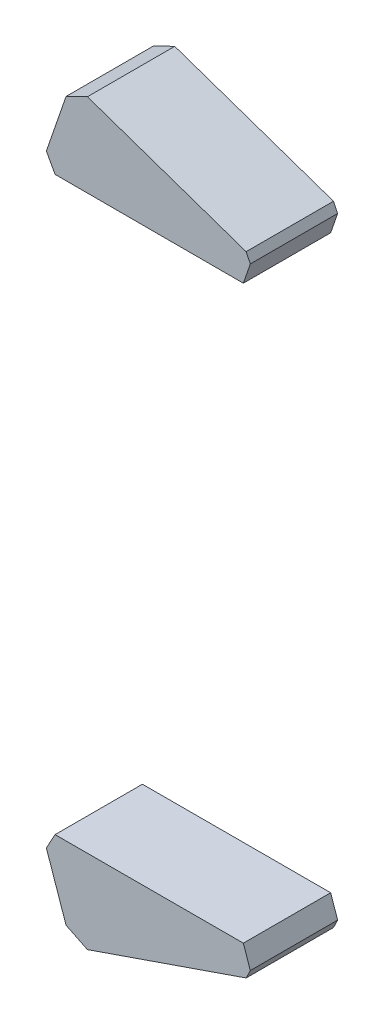
ISO-10303-21;
HEADER;
FILE_DESCRIPTION(('STEP AP214'),'2;1');
FILE_NAME('part.step','',(''),(''),'','','');
FILE_SCHEMA(('AUTOMOTIVE_DESIGN { 1 0 10303 214 1 1 1 1 }'));
ENDSEC;
DATA;
#1=APPLICATION_CONTEXT('core data for automotive mechanical design processes');
#2=APPLICATION_PROTOCOL_DEFINITION('international standard','automotive_design',2000,#1);
#3=PRODUCT_CONTEXT('',#1,'mechanical');
#4=PRODUCT('Part','Part','',(#3));
#5=PRODUCT_RELATED_PRODUCT_CATEGORY('part','',(#4));
#6=PRODUCT_DEFINITION_FORMATION('','',#4);
#7=PRODUCT_DEFINITION_CONTEXT('part definition',#1,'design');
#8=PRODUCT_DEFINITION('design','',#6,#7);
#9=PRODUCT_DEFINITION_SHAPE('','',#8);
#10=(LENGTH_UNIT() NAMED_UNIT(*) SI_UNIT(.MILLI.,.METRE.));
#11=(NAMED_UNIT(*) PLANE_ANGLE_UNIT() SI_UNIT($,.RADIAN.));
#12=(NAMED_UNIT(*) SI_UNIT($,.STERADIAN.) SOLID_ANGLE_UNIT());
#13=UNCERTAINTY_MEASURE_WITH_UNIT(LENGTH_MEASURE(1.E-05),#10,'distance_accuracy_value','');
#14=(GEOMETRIC_REPRESENTATION_CONTEXT(3) GLOBAL_UNCERTAINTY_ASSIGNED_CONTEXT((#13)) GLOBAL_UNIT_ASSIGNED_CONTEXT((#10,
#11,#12)) REPRESENTATION_CONTEXT('',''));
#15=CARTESIAN_POINT('',(0.,0.,0.));
#16=DIRECTION('',(0.,0.,1.));
#17=DIRECTION('',(1.,0.,0.));
#18=AXIS2_PLACEMENT_3D('',#15,#16,#17);
#19=CARTESIAN_POINT('',(-460.729069613653,-85.1233312154027,174.));
#20=DIRECTION('',(-0.876369714970138,0.481638996223481,0.));
#21=DIRECTION('',(-0.481638996223481,-0.876369714970138,0.));
#22=AXIS2_PLACEMENT_3D('',#19,#20,#21);
#23=PLANE('',#22);
#24=DIRECTION('',(0.481638996223481,0.876369714970137,0.));
#25=VECTOR('',#24,1.);
#26=CARTESIAN_POINT('',(-463.328308859307,-89.8527957619074,174.));
#27=LINE('',#26,#25);
#28=CARTESIAN_POINT('',(-463.328308859307,-89.8527957619074,174.));
#29=VERTEX_POINT('',#28);
#30=CARTESIAN_POINT('',(-460.729069613653,-85.1233312154027,174.));
#31=VERTEX_POINT('',#30);
#32=EDGE_CURVE('E140',#29,#31,#27,.T.);
#33=ORIENTED_EDGE('',*,*,#32,.F.);
#34=DIRECTION('',(0.,0.,1.));
#35=VECTOR('',#34,1.);
#36=CARTESIAN_POINT('',(-463.328308859307,-89.8527957619074,174.));
#37=LINE('',#36,#35);
#38=CARTESIAN_POINT('',(-463.328308859307,-89.8527957619074,200.));
#39=VERTEX_POINT('',#38);
#40=EDGE_CURVE('E179',#29,#39,#37,.T.);
#41=ORIENTED_EDGE('',*,*,#40,.T.);
#42=DIRECTION('',(-0.481638996223481,-0.876369714970138,0.));
#43=VECTOR('',#42,1.);
#44=CARTESIAN_POINT('',(-460.729069613653,-85.1233312154027,200.));
#45=LINE('',#44,#43);
#46=CARTESIAN_POINT('',(-460.729069613653,-85.1233312154027,200.));
#47=VERTEX_POINT('',#46);
#48=EDGE_CURVE('E170',#47,#39,#45,.T.);
#49=ORIENTED_EDGE('',*,*,#48,.F.);
#50=DIRECTION('',(0.,0.,1.));
#51=VECTOR('',#50,1.);
#52=CARTESIAN_POINT('',(-460.729069613653,-85.1233312154027,174.));
#53=LINE('',#52,#51);
#54=EDGE_CURVE('E138',#31,#47,#53,.T.);
#55=ORIENTED_EDGE('',*,*,#54,.F.);
#56=EDGE_LOOP('',(#33,#41,#49,#55));
#57=FACE_BOUND('',#56,.T.);
#58=ADVANCED_FACE('F273',(#57),#23,.T.);
#59=CARTESIAN_POINT('',(-404.675188024279,-85.0829941548219,174.));
#60=DIRECTION('',(-0.000719612076684251,0.999999741079198,0.));
#61=DIRECTION('',(-0.999999741079198,-0.000719612076684251,0.));
#62=AXIS2_PLACEMENT_3D('',#59,#60,#61);
#63=PLANE('',#62);
#64=DIRECTION('',(0.,0.,1.));
#65=VECTOR('',#64,1.);
#66=CARTESIAN_POINT('',(-404.675188024279,-85.0829941548219,174.));
#67=LINE('',#66,#65);
#68=CARTESIAN_POINT('',(-404.675188024279,-85.0829941548219,200.));
#69=VERTEX_POINT('',#68);
#70=CARTESIAN_POINT('',(-404.675188024279,-85.0829941548219,174.));
#71=VERTEX_POINT('',#70);
#72=EDGE_CURVE('E126',#69,#71,#67,.F.);
#73=ORIENTED_EDGE('',*,*,#72,.T.);
#74=DIRECTION('',(-0.999999741079198,-0.000719612076684251,0.));
#75=VECTOR('',#74,1.);
#76=CARTESIAN_POINT('',(-404.675188024279,-85.0829941548219,174.));
#77=LINE('',#76,#75);
#78=EDGE_CURVE('E119',#71,#31,#77,.T.);
#79=ORIENTED_EDGE('',*,*,#78,.T.);
#80=ORIENTED_EDGE('',*,*,#54,.T.);
#81=DIRECTION('',(-0.999999741079198,-0.000719612076684251,0.));
#82=VECTOR('',#81,1.);
#83=CARTESIAN_POINT('',(-404.675188024279,-85.0829941548219,200.));
#84=LINE('',#83,#82);
#85=EDGE_CURVE('E133',#47,#69,#84,.F.);
#86=ORIENTED_EDGE('',*,*,#85,.T.);
#87=EDGE_LOOP('',(#73,#79,#80,#86));
#88=FACE_BOUND('',#87,.T.);
#89=ADVANCED_FACE('F270',(#88),#63,.T.);
#90=CARTESIAN_POINT('',(-463.328308859307,-89.8527957619074,174.));
#91=DIRECTION('',(-0.945284048009157,-0.326248476746519,0.));
#92=DIRECTION('',(0.326248476746519,-0.945284048009157,0.));
#93=AXIS2_PLACEMENT_3D('',#90,#91,#92);
#94=PLANE('',#93);
#95=DIRECTION('',(0.326248476746519,-0.945284048009157,0.));
#96=VECTOR('',#95,1.);
#97=CARTESIAN_POINT('',(-464.510205805689,-86.4283251223888,200.));
#98=LINE('',#97,#96);
#99=CARTESIAN_POINT('',(-457.455836277869,-106.867908626072,200.));
#100=VERTEX_POINT('',#99);
#101=EDGE_CURVE('E167',#39,#100,#98,.T.);
#102=ORIENTED_EDGE('',*,*,#101,.F.);
#103=ORIENTED_EDGE('',*,*,#40,.F.);
#104=DIRECTION('',(0.326248476746519,-0.945284048009157,0.));
#105=VECTOR('',#104,1.);
#106=CARTESIAN_POINT('',(-464.510205805689,-86.4283251223888,174.));
#107=LINE('',#106,#105);
#108=CARTESIAN_POINT('',(-457.455836277869,-106.867908626072,174.));
#109=VERTEX_POINT('',#108);
#110=EDGE_CURVE('E143',#109,#29,#107,.F.);
#111=ORIENTED_EDGE('',*,*,#110,.F.);
#112=DIRECTION('',(0.,0.,1.));
#113=VECTOR('',#112,1.);
#114=CARTESIAN_POINT('',(-457.455836277869,-106.867908626072,174.));
#115=LINE('',#114,#113);
#116=EDGE_CURVE('E182',#109,#100,#115,.T.);
#117=ORIENTED_EDGE('',*,*,#116,.T.);
#118=EDGE_LOOP('',(#102,#103,#111,#117));
#119=FACE_BOUND('',#118,.T.);
#120=ADVANCED_FACE('F275',(#119),#94,.T.);
#121=CARTESIAN_POINT('',(-402.595900111108,-91.1075975955482,174.));
#122=DIRECTION('',(0.945284048009157,0.326248476746519,0.));
#123=DIRECTION('',(-0.326248476746519,0.945284048009157,0.));
#124=AXIS2_PLACEMENT_3D('',#121,#122,#123);
#125=PLANE('',#124);
#126=DIRECTION('',(0.326248476746519,-0.945284048009157,0.));
#127=VECTOR('',#126,1.);
#128=CARTESIAN_POINT('',(-410.629015069167,-67.8321619478372,174.));
#129=LINE('',#128,#127);
#130=CARTESIAN_POINT('',(-402.595900111108,-91.1075975955482,174.));
#131=VERTEX_POINT('',#130);
#132=EDGE_CURVE('E155',#71,#131,#129,.T.);
#133=ORIENTED_EDGE('',*,*,#132,.F.);
#134=ORIENTED_EDGE('',*,*,#72,.F.);
#135=DIRECTION('',(-0.326248476746519,0.945284048009157,0.));
#136=VECTOR('',#135,1.);
#137=CARTESIAN_POINT('',(-402.595900111108,-91.1075975955482,200.));
#138=LINE('',#137,#136);
#139=CARTESIAN_POINT('',(-402.595900111108,-91.1075975955482,200.));
#140=VERTEX_POINT('',#139);
#141=EDGE_CURVE('E161',#69,#140,#138,.F.);
#142=ORIENTED_EDGE('',*,*,#141,.T.);
#143=DIRECTION('',(0.,0.,1.));
#144=VECTOR('',#143,1.);
#145=CARTESIAN_POINT('',(-402.595900111108,-91.1075975955482,174.));
#146=LINE('',#145,#144);
#147=EDGE_CURVE('E158',#140,#131,#146,.F.);
#148=ORIENTED_EDGE('',*,*,#147,.T.);
#149=EDGE_LOOP('',(#133,#134,#142,#148));
#150=FACE_BOUND('',#149,.T.);
#151=ADVANCED_FACE('F268',(#150),#125,.T.);
#152=CARTESIAN_POINT('',(-464.510205805689,-86.4283251223888,174.));
#153=DIRECTION('',(0.,0.,-1.));
#154=DIRECTION('',(0.945284048009157,0.326248476746519,0.));
#155=AXIS2_PLACEMENT_3D('',#152,#153,#154);
#156=PLANE('',#155);
#157=ORIENTED_EDGE('',*,*,#32,.T.);
#158=ORIENTED_EDGE('',*,*,#78,.F.);
#159=ORIENTED_EDGE('',*,*,#132,.T.);
#160=DIRECTION('',(-0.437724250235498,-0.899109270753991,0.));
#161=VECTOR('',#160,1.);
#162=CARTESIAN_POINT('',(-402.595900111108,-91.1075975955482,174.));
#163=LINE('',#162,#161);
#164=CARTESIAN_POINT('',(-403.833971253633,-93.6506626450591,174.));
#165=VERTEX_POINT('',#164);
#166=EDGE_CURVE('E152',#131,#165,#163,.T.);
#167=ORIENTED_EDGE('',*,*,#166,.T.);
#168=DIRECTION('',(0.945284048009157,0.326248476746519,0.));
#169=VECTOR('',#168,1.);
#170=CARTESIAN_POINT('',(-455.824593894137,-111.594328866118,174.));
#171=LINE('',#170,#169);
#172=CARTESIAN_POINT('',(-451.098173654091,-109.963086482385,174.));
#173=VERTEX_POINT('',#172);
#174=EDGE_CURVE('E149',#165,#173,#171,.F.);
#175=ORIENTED_EDGE('',*,*,#174,.T.);
#176=DIRECTION('',(-0.89910927075399,0.4377242502355,0.));
#177=VECTOR('',#176,1.);
#178=CARTESIAN_POINT('',(-451.098173654091,-109.963086482385,174.));
#179=LINE('',#178,#177);
#180=EDGE_CURVE('E146',#173,#109,#179,.T.);
#181=ORIENTED_EDGE('',*,*,#180,.T.);
#182=ORIENTED_EDGE('',*,*,#110,.T.);
#183=EDGE_LOOP('',(#157,#158,#159,#167,#175,#181,#182));
#184=FACE_BOUND('',#183,.T.);
#185=ADVANCED_FACE('F265',(#184),#156,.T.);
#186=CARTESIAN_POINT('',(-457.455836277869,-106.867908626072,174.));
#187=DIRECTION('',(-0.4377242502355,-0.89910927075399,0.));
#188=DIRECTION('',(0.89910927075399,-0.4377242502355,0.));
#189=AXIS2_PLACEMENT_3D('',#186,#187,#188);
#190=PLANE('',#189);
#191=DIRECTION('',(0.89910927075399,-0.437724250235501,0.));
#192=VECTOR('',#191,1.);
#193=CARTESIAN_POINT('',(-457.455836277869,-106.867908626072,200.));
#194=LINE('',#193,#192);
#195=CARTESIAN_POINT('',(-451.098173654091,-109.963086482385,200.));
#196=VERTEX_POINT('',#195);
#197=EDGE_CURVE('E164',#100,#196,#194,.T.);
#198=ORIENTED_EDGE('',*,*,#197,.F.);
#199=ORIENTED_EDGE('',*,*,#116,.F.);
#200=ORIENTED_EDGE('',*,*,#180,.F.);
#201=DIRECTION('',(0.,0.,1.));
#202=VECTOR('',#201,1.);
#203=CARTESIAN_POINT('',(-451.098173654091,-109.963086482385,174.));
#204=LINE('',#203,#202);
#205=EDGE_CURVE('E185',#173,#196,#204,.T.);
#206=ORIENTED_EDGE('',*,*,#205,.T.);
#207=EDGE_LOOP('',(#198,#199,#200,#206));
#208=FACE_BOUND('',#207,.T.);
#209=ADVANCED_FACE('F261',(#208),#190,.T.);
#210=CARTESIAN_POINT('',(-410.629015069167,-67.8321619478372,200.));
#211=DIRECTION('',(0.,0.,1.));
#212=DIRECTION('',(-0.945284048009157,-0.326248476746519,0.));
#213=AXIS2_PLACEMENT_3D('',#210,#211,#212);
#214=PLANE('',#213);
#215=ORIENTED_EDGE('',*,*,#101,.T.);
#216=ORIENTED_EDGE('',*,*,#197,.T.);
#217=DIRECTION('',(-0.945284048009157,-0.326248476746519,0.));
#218=VECTOR('',#217,1.);
#219=CARTESIAN_POINT('',(-401.943403157614,-92.9981656915665,200.));
#220=LINE('',#219,#218);
#221=CARTESIAN_POINT('',(-403.833971253633,-93.6506626450591,200.));
#222=VERTEX_POINT('',#221);
#223=EDGE_CURVE('E176',#196,#222,#220,.F.);
#224=ORIENTED_EDGE('',*,*,#223,.T.);
#225=DIRECTION('',(0.437724250235496,0.899109270753992,0.));
#226=VECTOR('',#225,1.);
#227=CARTESIAN_POINT('',(-403.833971253633,-93.6506626450595,200.));
#228=LINE('',#227,#226);
#229=EDGE_CURVE('E173',#222,#140,#228,.T.);
#230=ORIENTED_EDGE('',*,*,#229,.T.);
#231=ORIENTED_EDGE('',*,*,#141,.F.);
#232=ORIENTED_EDGE('',*,*,#85,.F.);
#233=ORIENTED_EDGE('',*,*,#48,.T.);
#234=EDGE_LOOP('',(#215,#216,#224,#230,#231,#232,#233));
#235=FACE_BOUND('',#234,.T.);
#236=ADVANCED_FACE('F257',(#235),#214,.T.);
#237=CARTESIAN_POINT('',(-403.833971253633,-93.6506626450595,174.));
#238=DIRECTION('',(0.899109270753992,-0.437724250235497,0.));
#239=DIRECTION('',(0.437724250235497,0.899109270753992,0.));
#240=AXIS2_PLACEMENT_3D('',#237,#238,#239);
#241=PLANE('',#240);
#242=ORIENTED_EDGE('',*,*,#229,.F.);
#243=DIRECTION('',(0.,0.,1.));
#244=VECTOR('',#243,1.);
#245=CARTESIAN_POINT('',(-403.833971253633,-93.6506626450595,174.));
#246=LINE('',#245,#244);
#247=EDGE_CURVE('E188',#165,#222,#246,.T.);
#248=ORIENTED_EDGE('',*,*,#247,.F.);
#249=ORIENTED_EDGE('',*,*,#166,.F.);
#250=ORIENTED_EDGE('',*,*,#147,.F.);
#251=EDGE_LOOP('',(#242,#248,#249,#250));
#252=FACE_BOUND('',#251,.T.);
#253=ADVANCED_FACE('F255',(#252),#241,.T.);
#254=CARTESIAN_POINT('',(-353.452840480092,-76.2624847674652,258.594719087508));
#255=DIRECTION('',(0.326248476746523,-0.945284048009155,0.));
#256=DIRECTION('',(0.945284048009155,0.326248476746523,0.));
#257=AXIS2_PLACEMENT_3D('',#254,#255,#256);
#258=PLANE('',#257);
#259=ORIENTED_EDGE('',*,*,#247,.T.);
#260=ORIENTED_EDGE('',*,*,#223,.F.);
#261=ORIENTED_EDGE('',*,*,#205,.F.);
#262=ORIENTED_EDGE('',*,*,#174,.F.);
#263=EDGE_LOOP('',(#259,#260,#261,#262));
#264=FACE_BOUND('',#263,.T.);
#265=ADVANCED_FACE('F251',(#264),#258,.T.);
#266=CLOSED_SHELL('',(#58,#89,#120,#151,#185,#209,#236,#253,#265));
#267=MANIFOLD_SOLID_BREP('B1',#266);
#268=CARTESIAN_POINT('',(-460.729069613653,85.1233312154027,200.));
#269=DIRECTION('',(-0.876369714970138,-0.481638996223481,0.));
#270=DIRECTION('',(-0.481638996223481,0.876369714970138,0.));
#271=AXIS2_PLACEMENT_3D('',#268,#269,#270);
#272=PLANE('',#271);
#273=DIRECTION('',(0.481638996223481,-0.876369714970137,0.));
#274=VECTOR('',#273,1.);
#275=CARTESIAN_POINT('',(-463.328308859307,89.8527957619074,200.));
#276=LINE('',#275,#274);
#277=CARTESIAN_POINT('',(-463.328308859307,89.8527957619074,200.));
#278=VERTEX_POINT('',#277);
#279=CARTESIAN_POINT('',(-460.729069613653,85.1233312154027,200.));
#280=VERTEX_POINT('',#279);
#281=EDGE_CURVE('E87',#278,#280,#276,.T.);
#282=ORIENTED_EDGE('',*,*,#281,.F.);
#283=DIRECTION('',(0.,0.,-1.));
#284=VECTOR('',#283,1.);
#285=CARTESIAN_POINT('',(-463.328308859307,89.8527957619074,200.));
#286=LINE('',#285,#284);
#287=CARTESIAN_POINT('',(-463.328308859307,89.8527957619074,174.));
#288=VERTEX_POINT('',#287);
#289=EDGE_CURVE('E78',#278,#288,#286,.T.);
#290=ORIENTED_EDGE('',*,*,#289,.T.);
#291=DIRECTION('',(-0.481638996223481,0.876369714970138,0.));
#292=VECTOR('',#291,1.);
#293=CARTESIAN_POINT('',(-460.729069613653,85.1233312154027,174.));
#294=LINE('',#293,#292);
#295=CARTESIAN_POINT('',(-460.729069613653,85.1233312154027,174.));
#296=VERTEX_POINT('',#295);
#297=EDGE_CURVE('E108',#296,#288,#294,.T.);
#298=ORIENTED_EDGE('',*,*,#297,.F.);
#299=DIRECTION('',(0.,0.,-1.));
#300=VECTOR('',#299,1.);
#301=CARTESIAN_POINT('',(-460.729069613653,85.1233312154027,200.));
#302=LINE('',#301,#300);
#303=EDGE_CURVE('E196',#280,#296,#302,.T.);
#304=ORIENTED_EDGE('',*,*,#303,.F.);
#305=EDGE_LOOP('',(#282,#290,#298,#304));
#306=FACE_BOUND('',#305,.T.);
#307=ADVANCED_FACE('F17',(#306),#272,.T.);
#308=CARTESIAN_POINT('',(-404.675188024279,85.0829941548219,200.));
#309=DIRECTION('',(-0.000719612076684251,-0.999999741079198,0.));
#310=DIRECTION('',(-0.999999741079198,0.000719612076684251,0.));
#311=AXIS2_PLACEMENT_3D('',#308,#309,#310);
#312=PLANE('',#311);
#313=DIRECTION('',(0.,0.,-1.));
#314=VECTOR('',#313,1.);
#315=CARTESIAN_POINT('',(-404.675188024279,85.0829941548219,200.));
#316=LINE('',#315,#314);
#317=CARTESIAN_POINT('',(-404.675188024279,85.0829941548219,174.));
#318=VERTEX_POINT('',#317);
#319=CARTESIAN_POINT('',(-404.675188024279,85.0829941548219,200.));
#320=VERTEX_POINT('',#319);
#321=EDGE_CURVE('E28',#318,#320,#316,.F.);
#322=ORIENTED_EDGE('',*,*,#321,.T.);
#323=DIRECTION('',(-0.999999741079198,0.000719612076684251,0.));
#324=VECTOR('',#323,1.);
#325=CARTESIAN_POINT('',(-404.675188024279,85.0829941548219,200.));
#326=LINE('',#325,#324);
#327=EDGE_CURVE('E10',#320,#280,#326,.T.);
#328=ORIENTED_EDGE('',*,*,#327,.T.);
#329=ORIENTED_EDGE('',*,*,#303,.T.);
#330=DIRECTION('',(-0.999999741079198,0.000719612076684251,0.));
#331=VECTOR('',#330,1.);
#332=CARTESIAN_POINT('',(-404.675188024279,85.0829941548219,174.));
#333=LINE('',#332,#331);
#334=EDGE_CURVE('E193',#296,#318,#333,.F.);
#335=ORIENTED_EDGE('',*,*,#334,.T.);
#336=EDGE_LOOP('',(#322,#328,#329,#335));
#337=FACE_BOUND('',#336,.T.);
#338=ADVANCED_FACE('F19',(#337),#312,.T.);
#339=CARTESIAN_POINT('',(-463.328308859307,89.8527957619074,200.));
#340=DIRECTION('',(-0.945284048009157,0.326248476746519,0.));
#341=DIRECTION('',(0.326248476746519,0.945284048009157,0.));
#342=AXIS2_PLACEMENT_3D('',#339,#340,#341);
#343=PLANE('',#342);
#344=DIRECTION('',(0.326248476746519,0.945284048009157,0.));
#345=VECTOR('',#344,1.);
#346=CARTESIAN_POINT('',(-464.510205805689,86.4283251223888,174.));
#347=LINE('',#346,#345);
#348=CARTESIAN_POINT('',(-457.455836277869,106.867908626072,174.));
#349=VERTEX_POINT('',#348);
#350=EDGE_CURVE('E106',#288,#349,#347,.T.);
#351=ORIENTED_EDGE('',*,*,#350,.F.);
#352=ORIENTED_EDGE('',*,*,#289,.F.);
#353=DIRECTION('',(0.326248476746519,0.945284048009157,0.));
#354=VECTOR('',#353,1.);
#355=CARTESIAN_POINT('',(-464.510205805689,86.4283251223888,200.));
#356=LINE('',#355,#354);
#357=CARTESIAN_POINT('',(-457.455836277869,106.867908626072,200.));
#358=VERTEX_POINT('',#357);
#359=EDGE_CURVE('E82',#358,#278,#356,.F.);
#360=ORIENTED_EDGE('',*,*,#359,.F.);
#361=DIRECTION('',(0.,0.,-1.));
#362=VECTOR('',#361,1.);
#363=CARTESIAN_POINT('',(-457.455836277869,106.867908626072,200.));
#364=LINE('',#363,#362);
#365=EDGE_CURVE('E65',#358,#349,#364,.T.);
#366=ORIENTED_EDGE('',*,*,#365,.T.);
#367=EDGE_LOOP('',(#351,#352,#360,#366));
#368=FACE_BOUND('',#367,.T.);
#369=ADVANCED_FACE('F83',(#368),#343,.T.);
#370=CARTESIAN_POINT('',(-402.595900111108,91.1075975955482,200.));
#371=DIRECTION('',(0.945284048009157,-0.326248476746519,0.));
#372=DIRECTION('',(-0.326248476746519,-0.945284048009157,0.));
#373=AXIS2_PLACEMENT_3D('',#370,#371,#372);
#374=PLANE('',#373);
#375=DIRECTION('',(0.326248476746519,0.945284048009157,0.));
#376=VECTOR('',#375,1.);
#377=CARTESIAN_POINT('',(-410.629015069167,67.8321619478372,200.));
#378=LINE('',#377,#376);
#379=CARTESIAN_POINT('',(-402.595900111108,91.1075975955482,200.));
#380=VERTEX_POINT('',#379);
#381=EDGE_CURVE('E37',#320,#380,#378,.T.);
#382=ORIENTED_EDGE('',*,*,#381,.F.);
#383=ORIENTED_EDGE('',*,*,#321,.F.);
#384=DIRECTION('',(-0.326248476746519,-0.945284048009157,0.));
#385=VECTOR('',#384,1.);
#386=CARTESIAN_POINT('',(-402.595900111108,91.1075975955482,174.));
#387=LINE('',#386,#385);
#388=CARTESIAN_POINT('',(-402.595900111108,91.1075975955482,174.));
#389=VERTEX_POINT('',#388);
#390=EDGE_CURVE('E102',#318,#389,#387,.F.);
#391=ORIENTED_EDGE('',*,*,#390,.T.);
#392=DIRECTION('',(0.,0.,-1.));
#393=VECTOR('',#392,1.);
#394=CARTESIAN_POINT('',(-402.595900111108,91.1075975955482,200.));
#395=LINE('',#394,#393);
#396=EDGE_CURVE('E100',#389,#380,#395,.F.);
#397=ORIENTED_EDGE('',*,*,#396,.T.);
#398=EDGE_LOOP('',(#382,#383,#391,#397));
#399=FACE_BOUND('',#398,.T.);
#400=ADVANCED_FACE('F202',(#399),#374,.T.);
#401=CARTESIAN_POINT('',(-464.510205805689,86.4283251223888,200.));
#402=DIRECTION('',(0.,0.,1.));
#403=DIRECTION('',(0.945284048009157,-0.326248476746519,0.));
#404=AXIS2_PLACEMENT_3D('',#401,#402,#403);
#405=PLANE('',#404);
#406=ORIENTED_EDGE('',*,*,#281,.T.);
#407=ORIENTED_EDGE('',*,*,#327,.F.);
#408=ORIENTED_EDGE('',*,*,#381,.T.);
#409=DIRECTION('',(-0.437724250235498,0.899109270753991,0.));
#410=VECTOR('',#409,1.);
#411=CARTESIAN_POINT('',(-402.595900111108,91.1075975955482,200.));
#412=LINE('',#411,#410);
#413=CARTESIAN_POINT('',(-403.833971253633,93.6506626450591,200.));
#414=VERTEX_POINT('',#413);
#415=EDGE_CURVE('E94',#380,#414,#412,.T.);
#416=ORIENTED_EDGE('',*,*,#415,.T.);
#417=DIRECTION('',(0.945284048009157,-0.326248476746519,0.));
#418=VECTOR('',#417,1.);
#419=CARTESIAN_POINT('',(-455.824593894137,111.594328866118,200.));
#420=LINE('',#419,#418);
#421=CARTESIAN_POINT('',(-451.098173654091,109.963086482385,200.));
#422=VERTEX_POINT('',#421);
#423=EDGE_CURVE('E92',#414,#422,#420,.F.);
#424=ORIENTED_EDGE('',*,*,#423,.T.);
#425=DIRECTION('',(-0.89910927075399,-0.4377242502355,0.));
#426=VECTOR('',#425,1.);
#427=CARTESIAN_POINT('',(-451.098173654091,109.963086482385,200.));
#428=LINE('',#427,#426);
#429=EDGE_CURVE('E71',#422,#358,#428,.T.);
#430=ORIENTED_EDGE('',*,*,#429,.T.);
#431=ORIENTED_EDGE('',*,*,#359,.T.);
#432=EDGE_LOOP('',(#406,#407,#408,#416,#424,#430,#431));
#433=FACE_BOUND('',#432,.T.);
#434=ADVANCED_FACE('F89',(#433),#405,.T.);
#435=CARTESIAN_POINT('',(-457.455836277869,106.867908626072,200.));
#436=DIRECTION('',(-0.4377242502355,0.89910927075399,0.));
#437=DIRECTION('',(0.89910927075399,0.4377242502355,0.));
#438=AXIS2_PLACEMENT_3D('',#435,#436,#437);
#439=PLANE('',#438);
#440=DIRECTION('',(0.89910927075399,0.437724250235501,0.));
#441=VECTOR('',#440,1.);
#442=CARTESIAN_POINT('',(-457.455836277869,106.867908626072,174.));
#443=LINE('',#442,#441);
#444=CARTESIAN_POINT('',(-451.098173654091,109.963086482385,174.));
#445=VERTEX_POINT('',#444);
#446=EDGE_CURVE('E74',#349,#445,#443,.T.);
#447=ORIENTED_EDGE('',*,*,#446,.F.);
#448=ORIENTED_EDGE('',*,*,#365,.F.);
#449=ORIENTED_EDGE('',*,*,#429,.F.);
#450=DIRECTION('',(0.,0.,-1.));
#451=VECTOR('',#450,1.);
#452=CARTESIAN_POINT('',(-451.098173654091,109.963086482385,200.));
#453=LINE('',#452,#451);
#454=EDGE_CURVE('E79',#422,#445,#453,.T.);
#455=ORIENTED_EDGE('',*,*,#454,.T.);
#456=EDGE_LOOP('',(#447,#448,#449,#455));
#457=FACE_BOUND('',#456,.T.);
#458=ADVANCED_FACE('F67',(#457),#439,.T.);
#459=CARTESIAN_POINT('',(-410.629015069167,67.8321619478372,174.));
#460=DIRECTION('',(0.,0.,-1.));
#461=DIRECTION('',(-0.945284048009157,0.326248476746519,0.));
#462=AXIS2_PLACEMENT_3D('',#459,#460,#461);
#463=PLANE('',#462);
#464=ORIENTED_EDGE('',*,*,#350,.T.);
#465=ORIENTED_EDGE('',*,*,#446,.T.);
#466=DIRECTION('',(-0.945284048009157,0.326248476746519,0.));
#467=VECTOR('',#466,1.);
#468=CARTESIAN_POINT('',(-401.943403157614,92.9981656915665,174.));
#469=LINE('',#468,#467);
#470=CARTESIAN_POINT('',(-403.833971253633,93.6506626450591,174.));
#471=VERTEX_POINT('',#470);
#472=EDGE_CURVE('E113',#445,#471,#469,.F.);
#473=ORIENTED_EDGE('',*,*,#472,.T.);
#474=DIRECTION('',(0.437724250235496,-0.899109270753992,0.));
#475=VECTOR('',#474,1.);
#476=CARTESIAN_POINT('',(-403.833971253633,93.6506626450595,174.));
#477=LINE('',#476,#475);
#478=EDGE_CURVE('E111',#471,#389,#477,.T.);
#479=ORIENTED_EDGE('',*,*,#478,.T.);
#480=ORIENTED_EDGE('',*,*,#390,.F.);
#481=ORIENTED_EDGE('',*,*,#334,.F.);
#482=ORIENTED_EDGE('',*,*,#297,.T.);
#483=EDGE_LOOP('',(#464,#465,#473,#479,#480,#481,#482));
#484=FACE_BOUND('',#483,.T.);
#485=ADVANCED_FACE('F206',(#484),#463,.T.);
#486=CARTESIAN_POINT('',(-403.833971253633,93.6506626450595,200.));
#487=DIRECTION('',(0.899109270753992,0.437724250235497,0.));
#488=DIRECTION('',(0.437724250235497,-0.899109270753992,0.));
#489=AXIS2_PLACEMENT_3D('',#486,#487,#488);
#490=PLANE('',#489);
#491=ORIENTED_EDGE('',*,*,#478,.F.);
#492=DIRECTION('',(0.,0.,-1.));
#493=VECTOR('',#492,1.);
#494=CARTESIAN_POINT('',(-403.833971253633,93.6506626450595,200.));
#495=LINE('',#494,#493);
#496=EDGE_CURVE('E21',#414,#471,#495,.T.);
#497=ORIENTED_EDGE('',*,*,#496,.F.);
#498=ORIENTED_EDGE('',*,*,#415,.F.);
#499=ORIENTED_EDGE('',*,*,#396,.F.);
#500=EDGE_LOOP('',(#491,#497,#498,#499));
#501=FACE_BOUND('',#500,.T.);
#502=ADVANCED_FACE('F208',(#501),#490,.T.);
#503=CARTESIAN_POINT('',(-353.452840480092,76.2624847674652,323.213171234418));
#504=DIRECTION('',(-0.326248476746523,-0.945284048009155,0.));
#505=DIRECTION('',(0.945284048009155,-0.326248476746523,0.));
#506=AXIS2_PLACEMENT_3D('',#503,#504,#505);
#507=PLANE('',#506);
#508=ORIENTED_EDGE('',*,*,#423,.F.);
#509=ORIENTED_EDGE('',*,*,#496,.T.);
#510=ORIENTED_EDGE('',*,*,#472,.F.);
#511=ORIENTED_EDGE('',*,*,#454,.F.);
#512=EDGE_LOOP('',(#508,#509,#510,#511));
#513=FACE_BOUND('',#512,.T.);
#514=ADVANCED_FACE('F299',(#513),#507,.F.);
#515=CLOSED_SHELL('',(#307,#338,#369,#400,#434,#458,#485,#502,#514));
#516=MANIFOLD_SOLID_BREP('B1',#515);
#517=ADVANCED_BREP_SHAPE_REPRESENTATION('',(#18,#267,#516),#14);
#518=SHAPE_DEFINITION_REPRESENTATION(#9,#517);
ENDSEC;
END-ISO-10303-21;
